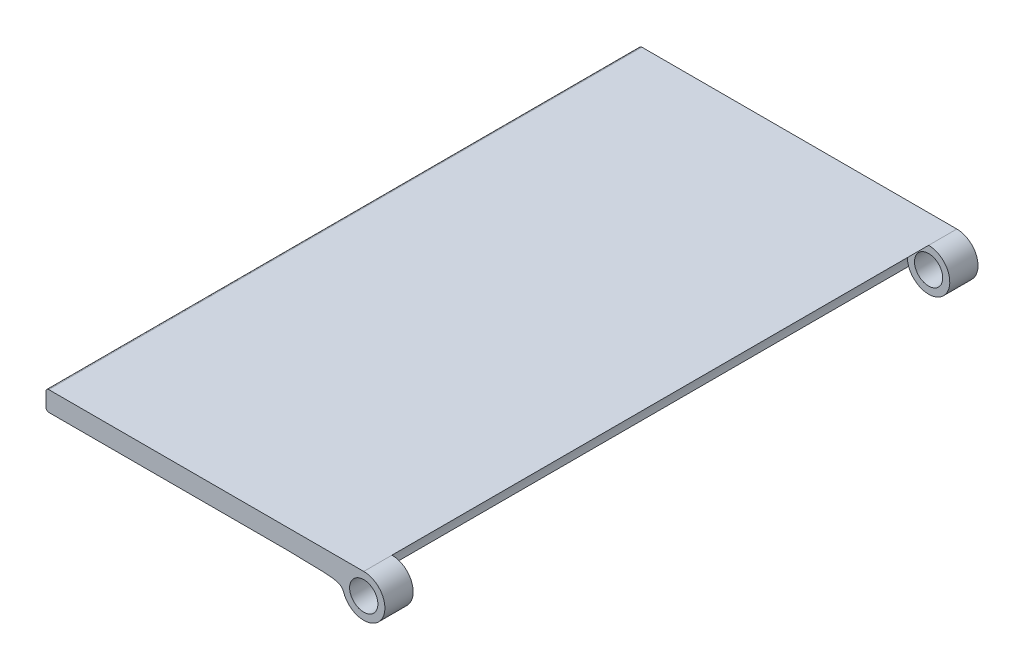
ISO-10303-21;
HEADER;
FILE_DESCRIPTION(('STEP AP214'),'2;1');
FILE_NAME('part.step','',(''),(''),'','','');
FILE_SCHEMA(('AUTOMOTIVE_DESIGN { 1 0 10303 214 1 1 1 1 }'));
ENDSEC;
DATA;
#1=APPLICATION_CONTEXT('core data for automotive mechanical design processes');
#2=APPLICATION_PROTOCOL_DEFINITION('international standard','automotive_design',2000,#1);
#3=PRODUCT_CONTEXT('',#1,'mechanical');
#4=PRODUCT('Part','Part','',(#3));
#5=PRODUCT_RELATED_PRODUCT_CATEGORY('part','',(#4));
#6=PRODUCT_DEFINITION_FORMATION('','',#4);
#7=PRODUCT_DEFINITION_CONTEXT('part definition',#1,'design');
#8=PRODUCT_DEFINITION('design','',#6,#7);
#9=PRODUCT_DEFINITION_SHAPE('','',#8);
#10=(LENGTH_UNIT() NAMED_UNIT(*) SI_UNIT(.MILLI.,.METRE.));
#11=(NAMED_UNIT(*) PLANE_ANGLE_UNIT() SI_UNIT($,.RADIAN.));
#12=(NAMED_UNIT(*) SI_UNIT($,.STERADIAN.) SOLID_ANGLE_UNIT());
#13=UNCERTAINTY_MEASURE_WITH_UNIT(LENGTH_MEASURE(1.E-05),#10,'distance_accuracy_value','');
#14=(GEOMETRIC_REPRESENTATION_CONTEXT(3) GLOBAL_UNCERTAINTY_ASSIGNED_CONTEXT((#13)) GLOBAL_UNIT_ASSIGNED_CONTEXT((#10,
#11,#12)) REPRESENTATION_CONTEXT('',''));
#15=CARTESIAN_POINT('',(0.,0.,0.));
#16=DIRECTION('',(0.,0.,1.));
#17=DIRECTION('',(1.,0.,0.));
#18=AXIS2_PLACEMENT_3D('',#15,#16,#17);
#19=CARTESIAN_POINT('',(112.5,7.5,210.));
#20=DIRECTION('',(0.,0.,-1.));
#21=DIRECTION('',(-1.,0.,0.));
#22=AXIS2_PLACEMENT_3D('',#19,#20,#21);
#23=CYLINDRICAL_SURFACE('',#22,7.50000000000001);
#24=CARTESIAN_POINT('',(112.5,7.5,200.));
#25=DIRECTION('',(0.,0.,-1.));
#26=DIRECTION('',(-1.,0.,0.));
#27=AXIS2_PLACEMENT_3D('',#24,#25,#26);
#28=CIRCLE('',#27,7.50000000000001);
#29=CARTESIAN_POINT('',(112.5,15.,200.));
#30=VERTEX_POINT('',#29);
#31=CARTESIAN_POINT('',(105.428932188123,5.00000000003196,200.));
#32=VERTEX_POINT('',#31);
#33=EDGE_CURVE('E218',#30,#32,#28,.T.);
#34=ORIENTED_EDGE('',*,*,#33,.F.);
#35=DIRECTION('',(0.,0.,-1.));
#36=VECTOR('',#35,1.);
#37=CARTESIAN_POINT('',(112.5,15.,210.));
#38=LINE('',#37,#36);
#39=CARTESIAN_POINT('',(112.5,15.,210.));
#40=VERTEX_POINT('',#39);
#41=EDGE_CURVE('E197',#40,#30,#38,.T.);
#42=ORIENTED_EDGE('',*,*,#41,.F.);
#43=CARTESIAN_POINT('',(112.5,7.5,210.));
#44=DIRECTION('',(0.,0.,1.));
#45=DIRECTION('',(1.,0.,0.));
#46=AXIS2_PLACEMENT_3D('',#43,#44,#45);
#47=CIRCLE('',#46,7.50000000000001);
#48=CARTESIAN_POINT('',(105.428932188123,5.00000000003196,210.));
#49=VERTEX_POINT('',#48);
#50=EDGE_CURVE('E60',#49,#40,#47,.T.);
#51=ORIENTED_EDGE('',*,*,#50,.F.);
#52=DIRECTION('',(0.,0.,-1.));
#53=VECTOR('',#52,1.);
#54=CARTESIAN_POINT('',(105.428932188123,5.00000000003196,210.));
#55=LINE('',#54,#53);
#56=EDGE_CURVE('E130',#49,#32,#55,.T.);
#57=ORIENTED_EDGE('',*,*,#56,.T.);
#58=EDGE_LOOP('',(#34,#42,#51,#57));
#59=FACE_BOUND('',#58,.T.);
#60=ADVANCED_FACE('F35',(#59),#23,.T.);
#61=CARTESIAN_POINT('',(112.5,7.5,210.));
#62=DIRECTION('',(0.,0.,-1.));
#63=DIRECTION('',(-1.,0.,0.));
#64=AXIS2_PLACEMENT_3D('',#61,#62,#63);
#65=CYLINDRICAL_SURFACE('',#64,5.);
#66=CARTESIAN_POINT('',(112.5,7.5,210.));
#67=DIRECTION('',(0.,0.,1.));
#68=DIRECTION('',(1.,0.,0.));
#69=AXIS2_PLACEMENT_3D('',#66,#67,#68);
#70=CIRCLE('',#69,5.);
#71=CARTESIAN_POINT('',(117.5,7.5,210.));
#72=VERTEX_POINT('',#71);
#73=EDGE_CURVE('E136',#72,#72,#70,.T.);
#74=ORIENTED_EDGE('',*,*,#73,.T.);
#75=EDGE_LOOP('',(#74));
#76=FACE_BOUND('',#75,.T.);
#77=CARTESIAN_POINT('',(112.5,7.5,200.));
#78=DIRECTION('',(0.,0.,-1.));
#79=DIRECTION('',(-1.,0.,0.));
#80=AXIS2_PLACEMENT_3D('',#77,#78,#79);
#81=CIRCLE('',#80,5.);
#82=CARTESIAN_POINT('',(107.5,7.5,200.));
#83=VERTEX_POINT('',#82);
#84=EDGE_CURVE('E210',#83,#83,#81,.T.);
#85=ORIENTED_EDGE('',*,*,#84,.T.);
#86=EDGE_LOOP('',(#85));
#87=FACE_BOUND('',#86,.T.);
#88=ADVANCED_FACE('F168',(#76,#87),#65,.F.);
#89=CARTESIAN_POINT('',(0.,15.,210.));
#90=DIRECTION('',(0.,1.,0.));
#91=DIRECTION('',(0.,0.,1.));
#92=AXIS2_PLACEMENT_3D('',#89,#90,#91);
#93=PLANE('',#92);
#94=DIRECTION('',(1.,0.,0.));
#95=VECTOR('',#94,1.);
#96=CARTESIAN_POINT('',(0.,15.,0.));
#97=LINE('',#96,#95);
#98=CARTESIAN_POINT('',(1.,15.,0.));
#99=VERTEX_POINT('',#98);
#100=CARTESIAN_POINT('',(112.5,15.,0.));
#101=VERTEX_POINT('',#100);
#102=EDGE_CURVE('E215',#99,#101,#97,.T.);
#103=ORIENTED_EDGE('',*,*,#102,.F.);
#104=DIRECTION('',(0.,0.,-1.));
#105=VECTOR('',#104,1.);
#106=CARTESIAN_POINT('',(1.,15.,210.));
#107=LINE('',#106,#105);
#108=CARTESIAN_POINT('',(1.,15.,210.));
#109=VERTEX_POINT('',#108);
#110=EDGE_CURVE('E11',#109,#99,#107,.T.);
#111=ORIENTED_EDGE('',*,*,#110,.F.);
#112=DIRECTION('',(1.,0.,0.));
#113=VECTOR('',#112,1.);
#114=CARTESIAN_POINT('',(0.,15.,210.));
#115=LINE('',#114,#113);
#116=EDGE_CURVE('E221',#109,#40,#115,.T.);
#117=ORIENTED_EDGE('',*,*,#116,.T.);
#118=ORIENTED_EDGE('',*,*,#41,.T.);
#119=CARTESIAN_POINT('',(112.5,15.,9.99999999999999));
#120=VERTEX_POINT('',#119);
#121=EDGE_CURVE('E195',#30,#120,#38,.T.);
#122=ORIENTED_EDGE('',*,*,#121,.T.);
#123=EDGE_CURVE('E90',#120,#101,#38,.T.);
#124=ORIENTED_EDGE('',*,*,#123,.T.);
#125=EDGE_LOOP('',(#103,#111,#117,#118,#122,#124));
#126=FACE_BOUND('',#125,.T.);
#127=ADVANCED_FACE('F37',(#126),#93,.T.);
#128=CARTESIAN_POINT('',(0.999999999999996,14.,210.));
#129=DIRECTION('',(0.,0.,-1.));
#130=DIRECTION('',(-1.,0.,0.));
#131=AXIS2_PLACEMENT_3D('',#128,#129,#130);
#132=CYLINDRICAL_SURFACE('',#131,1.);
#133=CARTESIAN_POINT('',(0.999999999999996,14.,0.));
#134=DIRECTION('',(0.,0.,1.));
#135=DIRECTION('',(1.,0.,0.));
#136=AXIS2_PLACEMENT_3D('',#133,#134,#135);
#137=CIRCLE('',#136,1.);
#138=CARTESIAN_POINT('',(0.,14.,0.));
#139=VERTEX_POINT('',#138);
#140=EDGE_CURVE('E274',#139,#99,#137,.F.);
#141=ORIENTED_EDGE('',*,*,#140,.F.);
#142=DIRECTION('',(0.,0.,-1.));
#143=VECTOR('',#142,1.);
#144=CARTESIAN_POINT('',(0.,14.,210.));
#145=LINE('',#144,#143);
#146=CARTESIAN_POINT('',(0.,14.,210.));
#147=VERTEX_POINT('',#146);
#148=EDGE_CURVE('E44',#147,#139,#145,.T.);
#149=ORIENTED_EDGE('',*,*,#148,.F.);
#150=CARTESIAN_POINT('',(0.999999999999996,14.,210.));
#151=DIRECTION('',(0.,0.,1.));
#152=DIRECTION('',(1.,0.,0.));
#153=AXIS2_PLACEMENT_3D('',#150,#151,#152);
#154=CIRCLE('',#153,1.);
#155=EDGE_CURVE('E223',#147,#109,#154,.F.);
#156=ORIENTED_EDGE('',*,*,#155,.T.);
#157=ORIENTED_EDGE('',*,*,#110,.T.);
#158=EDGE_LOOP('',(#141,#149,#156,#157));
#159=FACE_BOUND('',#158,.T.);
#160=ADVANCED_FACE('F160',(#159),#132,.T.);
#161=CARTESIAN_POINT('',(0.,0.,210.));
#162=DIRECTION('',(-1.,0.,0.));
#163=DIRECTION('',(0.,-1.,0.));
#164=AXIS2_PLACEMENT_3D('',#161,#162,#163);
#165=PLANE('',#164);
#166=DIRECTION('',(0.,1.,0.));
#167=VECTOR('',#166,1.);
#168=CARTESIAN_POINT('',(0.,0.,0.));
#169=LINE('',#168,#167);
#170=CARTESIAN_POINT('',(0.,9.00000000000484,0.));
#171=VERTEX_POINT('',#170);
#172=EDGE_CURVE('E239',#171,#139,#169,.T.);
#173=ORIENTED_EDGE('',*,*,#172,.F.);
#174=DIRECTION('',(0.,0.,-1.));
#175=VECTOR('',#174,1.);
#176=CARTESIAN_POINT('',(0.,9.00000000000484,210.));
#177=LINE('',#176,#175);
#178=CARTESIAN_POINT('',(0.,9.00000000000484,210.));
#179=VERTEX_POINT('',#178);
#180=EDGE_CURVE('E208',#179,#171,#177,.T.);
#181=ORIENTED_EDGE('',*,*,#180,.F.);
#182=DIRECTION('',(0.,1.,0.));
#183=VECTOR('',#182,1.);
#184=CARTESIAN_POINT('',(0.,0.,210.));
#185=LINE('',#184,#183);
#186=EDGE_CURVE('E226',#179,#147,#185,.T.);
#187=ORIENTED_EDGE('',*,*,#186,.T.);
#188=ORIENTED_EDGE('',*,*,#148,.T.);
#189=EDGE_LOOP('',(#173,#181,#187,#188));
#190=FACE_BOUND('',#189,.T.);
#191=ADVANCED_FACE('F157',(#190),#165,.T.);
#192=CARTESIAN_POINT('',(0.999999999999976,9.00000000000483,210.));
#193=DIRECTION('',(0.,0.,-1.));
#194=DIRECTION('',(-1.,0.,0.));
#195=AXIS2_PLACEMENT_3D('',#192,#193,#194);
#196=CYLINDRICAL_SURFACE('',#195,1.);
#197=CARTESIAN_POINT('',(0.999999999999976,9.00000000000483,0.));
#198=DIRECTION('',(0.,0.,1.));
#199=DIRECTION('',(1.,0.,0.));
#200=AXIS2_PLACEMENT_3D('',#197,#198,#199);
#201=CIRCLE('',#200,1.);
#202=CARTESIAN_POINT('',(0.999999999999926,8.00000000000483,0.));
#203=VERTEX_POINT('',#202);
#204=EDGE_CURVE('E231',#203,#171,#201,.F.);
#205=ORIENTED_EDGE('',*,*,#204,.F.);
#206=DIRECTION('',(0.,0.,-1.));
#207=VECTOR('',#206,1.);
#208=CARTESIAN_POINT('',(0.999999999999926,8.00000000000483,210.));
#209=LINE('',#208,#207);
#210=CARTESIAN_POINT('',(0.999999999999926,8.00000000000483,210.));
#211=VERTEX_POINT('',#210);
#212=EDGE_CURVE('E129',#211,#203,#209,.T.);
#213=ORIENTED_EDGE('',*,*,#212,.F.);
#214=CARTESIAN_POINT('',(0.999999999999976,9.00000000000483,210.));
#215=DIRECTION('',(0.,0.,1.));
#216=DIRECTION('',(1.,0.,0.));
#217=AXIS2_PLACEMENT_3D('',#214,#215,#216);
#218=CIRCLE('',#217,1.);
#219=EDGE_CURVE('E118',#211,#179,#218,.F.);
#220=ORIENTED_EDGE('',*,*,#219,.T.);
#221=ORIENTED_EDGE('',*,*,#180,.T.);
#222=EDGE_LOOP('',(#205,#213,#220,#221));
#223=FACE_BOUND('',#222,.T.);
#224=ADVANCED_FACE('F154',(#223),#196,.T.);
#225=CARTESIAN_POINT('',(4.60114750533177E-13,8.00000000000489,210.));
#226=DIRECTION('',(0.,1.,0.));
#227=DIRECTION('',(-1.,0.,0.));
#228=AXIS2_PLACEMENT_3D('',#225,#226,#227);
#229=PLANE('',#228);
#230=DIRECTION('',(1.,0.,0.));
#231=VECTOR('',#230,1.);
#232=CARTESIAN_POINT('',(4.60114750533177E-13,8.00000000000489,0.));
#233=LINE('',#232,#231);
#234=CARTESIAN_POINT('',(85.,8.,0.));
#235=VERTEX_POINT('',#234);
#236=EDGE_CURVE('E125',#203,#235,#233,.T.);
#237=ORIENTED_EDGE('',*,*,#236,.T.);
#238=DIRECTION('',(0.,0.,-1.));
#239=VECTOR('',#238,1.);
#240=CARTESIAN_POINT('',(85.,8.,210.));
#241=LINE('',#240,#239);
#242=CARTESIAN_POINT('',(85.,8.,210.));
#243=VERTEX_POINT('',#242);
#244=EDGE_CURVE('E122',#243,#235,#241,.T.);
#245=ORIENTED_EDGE('',*,*,#244,.F.);
#246=DIRECTION('',(1.,0.,0.));
#247=VECTOR('',#246,1.);
#248=CARTESIAN_POINT('',(4.60114750533177E-13,8.00000000000489,210.));
#249=LINE('',#248,#247);
#250=EDGE_CURVE('E109',#211,#243,#249,.T.);
#251=ORIENTED_EDGE('',*,*,#250,.F.);
#252=ORIENTED_EDGE('',*,*,#212,.T.);
#253=EDGE_LOOP('',(#237,#245,#251,#252));
#254=FACE_BOUND('',#253,.T.);
#255=ADVANCED_FACE('F123',(#254),#229,.F.);
#256=CARTESIAN_POINT('',(85.,8.,210.));
#257=CARTESIAN_POINT('',(102.874129484647,7.75119180444366,210.));
#258=CARTESIAN_POINT('',(104.316426779495,7.75352550704962,210.));
#259=CARTESIAN_POINT('',(105.428932188123,5.00000000003196,210.));
#260=B_SPLINE_CURVE_WITH_KNOTS('',3,(#256,#257,#258,#259),.UNSPECIFIED.,.F.,.F.,(4,4),(0.,1.),.UNSPECIFIED.);
#261=DIRECTION('',(0.,0.,-1.));
#262=VECTOR('',#261,1.);
#263=SURFACE_OF_LINEAR_EXTRUSION('',#260,#262);
#264=CARTESIAN_POINT('',(85.,8.,0.));
#265=CARTESIAN_POINT('',(102.874129484647,7.75119180444366,0.));
#266=CARTESIAN_POINT('',(104.316426779495,7.75352550704962,0.));
#267=CARTESIAN_POINT('',(105.428932188123,5.00000000003196,0.));
#268=B_SPLINE_CURVE_WITH_KNOTS('',3,(#264,#265,#266,#267),.UNSPECIFIED.,.F.,.F.,(4,4),(0.,1.),.UNSPECIFIED.);
#269=CARTESIAN_POINT('',(105.428932188123,5.00000000003196,0.));
#270=VERTEX_POINT('',#269);
#271=EDGE_CURVE('E236',#235,#270,#268,.T.);
#272=ORIENTED_EDGE('',*,*,#271,.T.);
#273=CARTESIAN_POINT('',(105.428932188123,5.00000000003196,9.99999999999999));
#274=VERTEX_POINT('',#273);
#275=EDGE_CURVE('E200',#274,#270,#55,.T.);
#276=ORIENTED_EDGE('',*,*,#275,.F.);
#277=EDGE_CURVE('E205',#32,#274,#55,.T.);
#278=ORIENTED_EDGE('',*,*,#277,.F.);
#279=ORIENTED_EDGE('',*,*,#56,.F.);
#280=EDGE_CURVE('E114',#243,#49,#260,.T.);
#281=ORIENTED_EDGE('',*,*,#280,.F.);
#282=ORIENTED_EDGE('',*,*,#244,.T.);
#283=EDGE_LOOP('',(#272,#276,#278,#279,#281,#282));
#284=FACE_BOUND('',#283,.T.);
#285=ADVANCED_FACE('F132',(#284),#263,.F.);
#286=ORIENTED_EDGE('',*,*,#123,.F.);
#287=CARTESIAN_POINT('',(112.5,7.5,9.99999999999999));
#288=DIRECTION('',(0.,0.,-1.));
#289=DIRECTION('',(-1.,0.,0.));
#290=AXIS2_PLACEMENT_3D('',#287,#288,#289);
#291=CIRCLE('',#290,7.50000000000001);
#292=EDGE_CURVE('E188',#120,#274,#291,.T.);
#293=ORIENTED_EDGE('',*,*,#292,.T.);
#294=ORIENTED_EDGE('',*,*,#275,.T.);
#295=CARTESIAN_POINT('',(112.5,7.5,0.));
#296=DIRECTION('',(0.,0.,1.));
#297=DIRECTION('',(1.,0.,0.));
#298=AXIS2_PLACEMENT_3D('',#295,#296,#297);
#299=CIRCLE('',#298,7.50000000000001);
#300=EDGE_CURVE('E191',#270,#101,#299,.T.);
#301=ORIENTED_EDGE('',*,*,#300,.T.);
#302=EDGE_LOOP('',(#286,#293,#294,#301));
#303=FACE_BOUND('',#302,.T.);
#304=ADVANCED_FACE('F150',(#303),#23,.T.);
#305=CARTESIAN_POINT('',(112.5,7.5,9.99999999999998));
#306=DIRECTION('',(0.,0.,-1.));
#307=DIRECTION('',(-1.,0.,0.));
#308=AXIS2_PLACEMENT_3D('',#305,#306,#307);
#309=CIRCLE('',#308,5.);
#310=CARTESIAN_POINT('',(107.5,7.5,9.99999999999998));
#311=VERTEX_POINT('',#310);
#312=EDGE_CURVE('E39',#311,#311,#309,.T.);
#313=ORIENTED_EDGE('',*,*,#312,.F.);
#314=EDGE_LOOP('',(#313));
#315=FACE_BOUND('',#314,.T.);
#316=CARTESIAN_POINT('',(112.5,7.5,0.));
#317=DIRECTION('',(0.,0.,1.));
#318=DIRECTION('',(1.,0.,0.));
#319=AXIS2_PLACEMENT_3D('',#316,#317,#318);
#320=CIRCLE('',#319,5.);
#321=CARTESIAN_POINT('',(117.5,7.5,0.));
#322=VERTEX_POINT('',#321);
#323=EDGE_CURVE('E203',#322,#322,#320,.T.);
#324=ORIENTED_EDGE('',*,*,#323,.F.);
#325=EDGE_LOOP('',(#324));
#326=FACE_BOUND('',#325,.T.);
#327=ADVANCED_FACE('F177',(#315,#326),#65,.F.);
#328=CARTESIAN_POINT('',(0.,0.,210.));
#329=DIRECTION('',(0.,0.,1.));
#330=DIRECTION('',(1.,0.,0.));
#331=AXIS2_PLACEMENT_3D('',#328,#329,#330);
#332=PLANE('',#331);
#333=ORIENTED_EDGE('',*,*,#116,.F.);
#334=ORIENTED_EDGE('',*,*,#155,.F.);
#335=ORIENTED_EDGE('',*,*,#186,.F.);
#336=ORIENTED_EDGE('',*,*,#219,.F.);
#337=ORIENTED_EDGE('',*,*,#250,.T.);
#338=ORIENTED_EDGE('',*,*,#280,.T.);
#339=ORIENTED_EDGE('',*,*,#50,.T.);
#340=EDGE_LOOP('',(#333,#334,#335,#336,#337,#338,#339));
#341=FACE_BOUND('',#340,.T.);
#342=ORIENTED_EDGE('',*,*,#73,.F.);
#343=EDGE_LOOP('',(#342));
#344=FACE_BOUND('',#343,.T.);
#345=ADVANCED_FACE('F111',(#341,#344),#332,.T.);
#346=CARTESIAN_POINT('',(0.,0.,0.));
#347=DIRECTION('',(0.,0.,1.));
#348=DIRECTION('',(1.,0.,0.));
#349=AXIS2_PLACEMENT_3D('',#346,#347,#348);
#350=PLANE('',#349);
#351=ORIENTED_EDGE('',*,*,#102,.T.);
#352=ORIENTED_EDGE('',*,*,#300,.F.);
#353=ORIENTED_EDGE('',*,*,#271,.F.);
#354=ORIENTED_EDGE('',*,*,#236,.F.);
#355=ORIENTED_EDGE('',*,*,#204,.T.);
#356=ORIENTED_EDGE('',*,*,#172,.T.);
#357=ORIENTED_EDGE('',*,*,#140,.T.);
#358=EDGE_LOOP('',(#351,#352,#353,#354,#355,#356,#357));
#359=FACE_BOUND('',#358,.T.);
#360=ORIENTED_EDGE('',*,*,#323,.T.);
#361=EDGE_LOOP('',(#360));
#362=FACE_BOUND('',#361,.T.);
#363=ADVANCED_FACE('F233',(#359,#362),#350,.F.);
#364=CARTESIAN_POINT('',(112.5,7.5,9.99999999999999));
#365=DIRECTION('',(0.,0.,1.));
#366=DIRECTION('',(1.,0.,0.));
#367=AXIS2_PLACEMENT_3D('',#364,#365,#366);
#368=CYLINDRICAL_SURFACE('',#367,7.50000000000001);
#369=EDGE_CURVE('E51',#32,#30,#28,.T.);
#370=ORIENTED_EDGE('',*,*,#369,.F.);
#371=ORIENTED_EDGE('',*,*,#277,.T.);
#372=EDGE_CURVE('E216',#274,#120,#291,.T.);
#373=ORIENTED_EDGE('',*,*,#372,.T.);
#374=ORIENTED_EDGE('',*,*,#121,.F.);
#375=EDGE_LOOP('',(#370,#371,#373,#374));
#376=FACE_BOUND('',#375,.T.);
#377=ADVANCED_FACE('F251',(#376),#368,.F.);
#378=CARTESIAN_POINT('',(112.5,7.5,9.99999999999999));
#379=DIRECTION('',(0.,0.,-1.));
#380=DIRECTION('',(-1.,0.,0.));
#381=AXIS2_PLACEMENT_3D('',#378,#379,#380);
#382=PLANE('',#381);
#383=ORIENTED_EDGE('',*,*,#312,.T.);
#384=EDGE_LOOP('',(#383));
#385=FACE_BOUND('',#384,.T.);
#386=ORIENTED_EDGE('',*,*,#292,.F.);
#387=ORIENTED_EDGE('',*,*,#372,.F.);
#388=EDGE_LOOP('',(#386,#387));
#389=FACE_BOUND('',#388,.T.);
#390=ADVANCED_FACE('F257',(#385,#389),#382,.F.);
#391=CARTESIAN_POINT('',(112.5,7.5,200.));
#392=DIRECTION('',(0.,0.,-1.));
#393=DIRECTION('',(-1.,0.,0.));
#394=AXIS2_PLACEMENT_3D('',#391,#392,#393);
#395=PLANE('',#394);
#396=ORIENTED_EDGE('',*,*,#84,.F.);
#397=EDGE_LOOP('',(#396));
#398=FACE_BOUND('',#397,.T.);
#399=ORIENTED_EDGE('',*,*,#33,.T.);
#400=ORIENTED_EDGE('',*,*,#369,.T.);
#401=EDGE_LOOP('',(#399,#400));
#402=FACE_BOUND('',#401,.T.);
#403=ADVANCED_FACE('F263',(#398,#402),#395,.T.);
#404=CLOSED_SHELL('',(#60,#88,#127,#160,#191,#224,#255,#285,#304,#327,#345,#363,#377,#390,#403));
#405=MANIFOLD_SOLID_BREP('B2',#404);
#406=ADVANCED_BREP_SHAPE_REPRESENTATION('',(#18,#405),#14);
#407=SHAPE_DEFINITION_REPRESENTATION(#9,#406);
ENDSEC;
END-ISO-10303-21;
